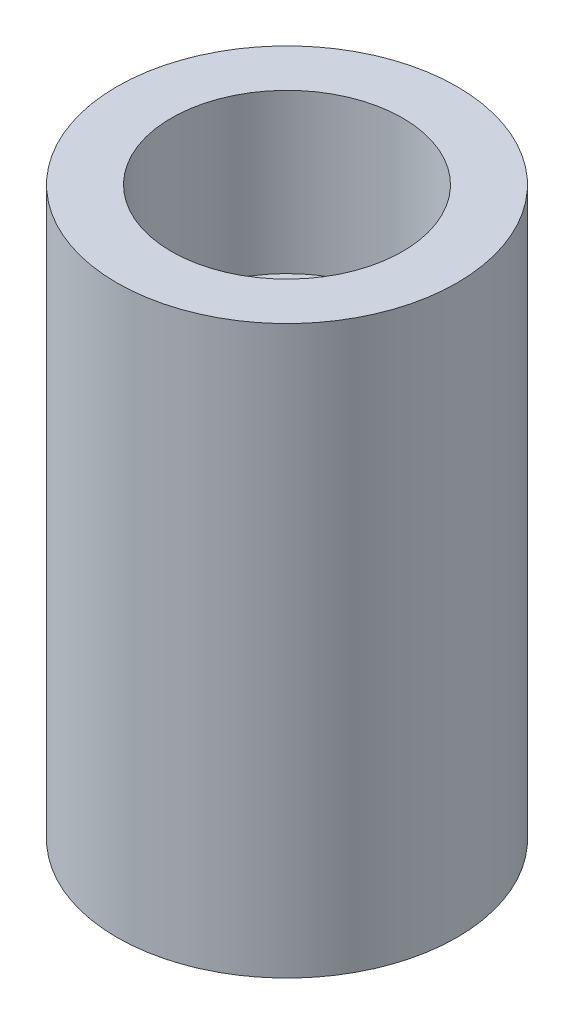
ISO-10303-21;
HEADER;
FILE_DESCRIPTION(('STEP AP214'),'2;1');
FILE_NAME('part.step','',(''),(''),'','','');
FILE_SCHEMA(('AUTOMOTIVE_DESIGN { 1 0 10303 214 1 1 1 1 }'));
ENDSEC;
DATA;
#1=APPLICATION_CONTEXT('core data for automotive mechanical design processes');
#2=APPLICATION_PROTOCOL_DEFINITION('international standard','automotive_design',2000,#1);
#3=PRODUCT_CONTEXT('',#1,'mechanical');
#4=PRODUCT('Part','Part','',(#3));
#5=PRODUCT_RELATED_PRODUCT_CATEGORY('part','',(#4));
#6=PRODUCT_DEFINITION_FORMATION('','',#4);
#7=PRODUCT_DEFINITION_CONTEXT('part definition',#1,'design');
#8=PRODUCT_DEFINITION('design','',#6,#7);
#9=PRODUCT_DEFINITION_SHAPE('','',#8);
#10=(LENGTH_UNIT() NAMED_UNIT(*) SI_UNIT(.MILLI.,.METRE.));
#11=(NAMED_UNIT(*) PLANE_ANGLE_UNIT() SI_UNIT($,.RADIAN.));
#12=(NAMED_UNIT(*) SI_UNIT($,.STERADIAN.) SOLID_ANGLE_UNIT());
#13=UNCERTAINTY_MEASURE_WITH_UNIT(LENGTH_MEASURE(1.E-05),#10,'distance_accuracy_value','');
#14=(GEOMETRIC_REPRESENTATION_CONTEXT(3) GLOBAL_UNCERTAINTY_ASSIGNED_CONTEXT((#13)) GLOBAL_UNIT_ASSIGNED_CONTEXT((#10,
#11,#12)) REPRESENTATION_CONTEXT('',''));
#15=CARTESIAN_POINT('',(0.,0.,0.));
#16=DIRECTION('',(0.,0.,1.));
#17=DIRECTION('',(1.,0.,0.));
#18=AXIS2_PLACEMENT_3D('',#15,#16,#17);
#19=CARTESIAN_POINT('',(0.,25.,0.));
#20=DIRECTION('',(0.,-1.,0.));
#21=DIRECTION('',(0.,0.,-1.));
#22=AXIS2_PLACEMENT_3D('',#19,#20,#21);
#23=CYLINDRICAL_SURFACE('',#22,7.5);
#24=CARTESIAN_POINT('',(0.,25.,0.));
#25=DIRECTION('',(0.,1.,0.));
#26=DIRECTION('',(0.,0.,1.));
#27=AXIS2_PLACEMENT_3D('',#24,#25,#26);
#28=CIRCLE('',#27,7.5);
#29=CARTESIAN_POINT('',(0.,25.,7.5));
#30=VERTEX_POINT('',#29);
#31=EDGE_CURVE('E10',#30,#30,#28,.T.);
#32=ORIENTED_EDGE('',*,*,#31,.F.);
#33=EDGE_LOOP('',(#32));
#34=FACE_BOUND('',#33,.T.);
#35=CARTESIAN_POINT('',(0.,0.,0.));
#36=DIRECTION('',(0.,1.,0.));
#37=DIRECTION('',(0.,0.,1.));
#38=AXIS2_PLACEMENT_3D('',#35,#36,#37);
#39=CIRCLE('',#38,7.5);
#40=CARTESIAN_POINT('',(0.,0.,7.5));
#41=VERTEX_POINT('',#40);
#42=EDGE_CURVE('E38',#41,#41,#39,.T.);
#43=ORIENTED_EDGE('',*,*,#42,.T.);
#44=EDGE_LOOP('',(#43));
#45=FACE_BOUND('',#44,.T.);
#46=ADVANCED_FACE('F31',(#34,#45),#23,.T.);
#47=CARTESIAN_POINT('',(0.,25.,0.));
#48=DIRECTION('',(0.,1.,0.));
#49=DIRECTION('',(0.,0.,1.));
#50=AXIS2_PLACEMENT_3D('',#47,#48,#49);
#51=PLANE('',#50);
#52=CARTESIAN_POINT('',(0.,25.,0.));
#53=DIRECTION('',(0.,1.,0.));
#54=DIRECTION('',(0.,0.,1.));
#55=AXIS2_PLACEMENT_3D('',#52,#53,#54);
#56=CIRCLE('',#55,5.1);
#57=CARTESIAN_POINT('',(0.,25.,5.1));
#58=VERTEX_POINT('',#57);
#59=EDGE_CURVE('E51',#58,#58,#56,.T.);
#60=ORIENTED_EDGE('',*,*,#59,.F.);
#61=EDGE_LOOP('',(#60));
#62=FACE_BOUND('',#61,.T.);
#63=ORIENTED_EDGE('',*,*,#31,.T.);
#64=EDGE_LOOP('',(#63));
#65=FACE_BOUND('',#64,.T.);
#66=ADVANCED_FACE('F81',(#62,#65),#51,.T.);
#67=CARTESIAN_POINT('',(0.,0.,0.));
#68=DIRECTION('',(0.,1.,0.));
#69=DIRECTION('',(0.,0.,1.));
#70=AXIS2_PLACEMENT_3D('',#67,#68,#69);
#71=PLANE('',#70);
#72=CARTESIAN_POINT('',(0.,0.,0.));
#73=DIRECTION('',(0.,-1.,0.));
#74=DIRECTION('',(0.,0.,-1.));
#75=AXIS2_PLACEMENT_3D('',#72,#73,#74);
#76=CIRCLE('',#75,5.1);
#77=CARTESIAN_POINT('',(0.,0.,-5.1));
#78=VERTEX_POINT('',#77);
#79=EDGE_CURVE('E45',#78,#78,#76,.T.);
#80=ORIENTED_EDGE('',*,*,#79,.F.);
#81=EDGE_LOOP('',(#80));
#82=FACE_BOUND('',#81,.T.);
#83=ORIENTED_EDGE('',*,*,#42,.F.);
#84=EDGE_LOOP('',(#83));
#85=FACE_BOUND('',#84,.T.);
#86=ADVANCED_FACE('F75',(#82,#85),#71,.F.);
#87=CARTESIAN_POINT('',(0.,7.,0.));
#88=DIRECTION('',(0.,-1.,0.));
#89=DIRECTION('',(0.,0.,-1.));
#90=AXIS2_PLACEMENT_3D('',#87,#88,#89);
#91=CYLINDRICAL_SURFACE('',#90,5.1);
#92=CARTESIAN_POINT('',(0.,7.,0.));
#93=DIRECTION('',(0.,-1.,0.));
#94=DIRECTION('',(0.,0.,-1.));
#95=AXIS2_PLACEMENT_3D('',#92,#93,#94);
#96=CIRCLE('',#95,5.1);
#97=CARTESIAN_POINT('',(0.,7.,-5.1));
#98=VERTEX_POINT('',#97);
#99=EDGE_CURVE('E43',#98,#98,#96,.T.);
#100=ORIENTED_EDGE('',*,*,#99,.F.);
#101=EDGE_LOOP('',(#100));
#102=FACE_BOUND('',#101,.T.);
#103=ORIENTED_EDGE('',*,*,#79,.T.);
#104=EDGE_LOOP('',(#103));
#105=FACE_BOUND('',#104,.T.);
#106=ADVANCED_FACE('F69',(#102,#105),#91,.F.);
#107=CARTESIAN_POINT('',(0.,7.,0.));
#108=DIRECTION('',(0.,-1.,0.));
#109=DIRECTION('',(0.,0.,-1.));
#110=AXIS2_PLACEMENT_3D('',#107,#108,#109);
#111=PLANE('',#110);
#112=CARTESIAN_POINT('',(0.,7.,0.));
#113=DIRECTION('',(0.,-1.,0.));
#114=DIRECTION('',(0.,0.,-1.));
#115=AXIS2_PLACEMENT_3D('',#112,#113,#114);
#116=CIRCLE('',#115,4.);
#117=CARTESIAN_POINT('',(0.,7.,-4.));
#118=VERTEX_POINT('',#117);
#119=EDGE_CURVE('E34',#118,#118,#116,.T.);
#120=ORIENTED_EDGE('',*,*,#119,.F.);
#121=EDGE_LOOP('',(#120));
#122=FACE_BOUND('',#121,.T.);
#123=ORIENTED_EDGE('',*,*,#99,.T.);
#124=EDGE_LOOP('',(#123));
#125=FACE_BOUND('',#124,.T.);
#126=ADVANCED_FACE('F65',(#122,#125),#111,.T.);
#127=CARTESIAN_POINT('',(0.,18.,0.));
#128=DIRECTION('',(0.,1.,0.));
#129=DIRECTION('',(0.,0.,1.));
#130=AXIS2_PLACEMENT_3D('',#127,#128,#129);
#131=CYLINDRICAL_SURFACE('',#130,5.1);
#132=CARTESIAN_POINT('',(0.,18.,0.));
#133=DIRECTION('',(0.,1.,0.));
#134=DIRECTION('',(0.,0.,1.));
#135=AXIS2_PLACEMENT_3D('',#132,#133,#134);
#136=CIRCLE('',#135,5.1);
#137=CARTESIAN_POINT('',(0.,18.,5.1));
#138=VERTEX_POINT('',#137);
#139=EDGE_CURVE('E48',#138,#138,#136,.T.);
#140=ORIENTED_EDGE('',*,*,#139,.F.);
#141=EDGE_LOOP('',(#140));
#142=FACE_BOUND('',#141,.T.);
#143=ORIENTED_EDGE('',*,*,#59,.T.);
#144=EDGE_LOOP('',(#143));
#145=FACE_BOUND('',#144,.T.);
#146=ADVANCED_FACE('F68',(#142,#145),#131,.F.);
#147=CARTESIAN_POINT('',(0.,18.,0.));
#148=DIRECTION('',(0.,1.,0.));
#149=DIRECTION('',(0.,0.,1.));
#150=AXIS2_PLACEMENT_3D('',#147,#148,#149);
#151=PLANE('',#150);
#152=CARTESIAN_POINT('',(0.,18.,0.));
#153=DIRECTION('',(0.,1.,0.));
#154=DIRECTION('',(0.,0.,1.));
#155=AXIS2_PLACEMENT_3D('',#152,#153,#154);
#156=CIRCLE('',#155,4.);
#157=CARTESIAN_POINT('',(0.,18.,4.));
#158=VERTEX_POINT('',#157);
#159=EDGE_CURVE('E56',#158,#158,#156,.T.);
#160=ORIENTED_EDGE('',*,*,#159,.F.);
#161=EDGE_LOOP('',(#160));
#162=FACE_BOUND('',#161,.T.);
#163=ORIENTED_EDGE('',*,*,#139,.T.);
#164=EDGE_LOOP('',(#163));
#165=FACE_BOUND('',#164,.T.);
#166=ADVANCED_FACE('F97',(#162,#165),#151,.T.);
#167=CARTESIAN_POINT('',(0.,0.,0.));
#168=DIRECTION('',(0.,1.,0.));
#169=DIRECTION('',(0.,0.,1.));
#170=AXIS2_PLACEMENT_3D('',#167,#168,#169);
#171=CYLINDRICAL_SURFACE('',#170,4.);
#172=ORIENTED_EDGE('',*,*,#119,.T.);
#173=EDGE_LOOP('',(#172));
#174=FACE_BOUND('',#173,.T.);
#175=ORIENTED_EDGE('',*,*,#159,.T.);
#176=EDGE_LOOP('',(#175));
#177=FACE_BOUND('',#176,.T.);
#178=ADVANCED_FACE('F63',(#174,#177),#171,.F.);
#179=CLOSED_SHELL('',(#46,#66,#86,#106,#126,#146,#166,#178));
#180=MANIFOLD_SOLID_BREP('B2',#179);
#181=ADVANCED_BREP_SHAPE_REPRESENTATION('',(#18,#180),#14);
#182=SHAPE_DEFINITION_REPRESENTATION(#9,#181);
ENDSEC;
END-ISO-10303-21;
